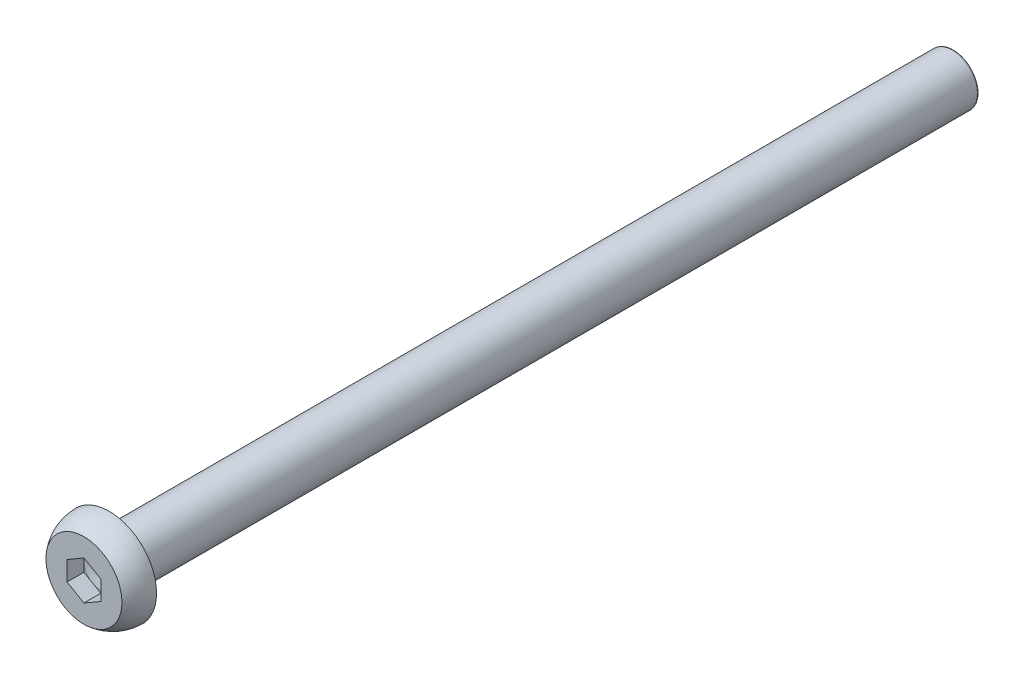
ISO-10303-21;
HEADER;
FILE_DESCRIPTION(('STEP AP214'),'2;1');
FILE_NAME('part.step','',(''),(''),'','','');
FILE_SCHEMA(('AUTOMOTIVE_DESIGN { 1 0 10303 214 1 1 1 1 }'));
ENDSEC;
DATA;
#1=APPLICATION_CONTEXT('core data for automotive mechanical design processes');
#2=APPLICATION_PROTOCOL_DEFINITION('international standard','automotive_design',2000,#1);
#3=PRODUCT_CONTEXT('',#1,'mechanical');
#4=PRODUCT('Part','Part','',(#3));
#5=PRODUCT_RELATED_PRODUCT_CATEGORY('part','',(#4));
#6=PRODUCT_DEFINITION_FORMATION('','',#4);
#7=PRODUCT_DEFINITION_CONTEXT('part definition',#1,'design');
#8=PRODUCT_DEFINITION('design','',#6,#7);
#9=PRODUCT_DEFINITION_SHAPE('','',#8);
#10=(LENGTH_UNIT() NAMED_UNIT(*) SI_UNIT(.MILLI.,.METRE.));
#11=(NAMED_UNIT(*) PLANE_ANGLE_UNIT() SI_UNIT($,.RADIAN.));
#12=(NAMED_UNIT(*) SI_UNIT($,.STERADIAN.) SOLID_ANGLE_UNIT());
#13=UNCERTAINTY_MEASURE_WITH_UNIT(LENGTH_MEASURE(1.E-05),#10,'distance_accuracy_value','');
#14=(GEOMETRIC_REPRESENTATION_CONTEXT(3) GLOBAL_UNCERTAINTY_ASSIGNED_CONTEXT((#13)) GLOBAL_UNIT_ASSIGNED_CONTEXT((#10,
#11,#12)) REPRESENTATION_CONTEXT('',''));
#15=CARTESIAN_POINT('',(0.,0.,0.));
#16=DIRECTION('',(0.,0.,1.));
#17=DIRECTION('',(1.,0.,0.));
#18=AXIS2_PLACEMENT_3D('',#15,#16,#17);
#19=CARTESIAN_POINT('',(0.,1.5,-51.5));
#20=DIRECTION('',(0.,0.,1.));
#21=DIRECTION('',(1.,0.,0.));
#22=AXIS2_PLACEMENT_3D('',#19,#20,#21);
#23=PLANE('',#22);
#24=CARTESIAN_POINT('',(0.,0.,-51.5));
#25=DIRECTION('',(0.,0.,1.));
#26=DIRECTION('',(1.,0.,0.));
#27=AXIS2_PLACEMENT_3D('',#24,#25,#26);
#28=CIRCLE('',#27,1.4);
#29=CARTESIAN_POINT('',(1.4,0.,-51.5));
#30=VERTEX_POINT('',#29);
#31=EDGE_CURVE('E11',#30,#30,#28,.F.);
#32=ORIENTED_EDGE('',*,*,#31,.T.);
#33=EDGE_LOOP('',(#32));
#34=FACE_BOUND('',#33,.T.);
#35=ADVANCED_FACE('F45',(#34),#23,.F.);
#36=CARTESIAN_POINT('',(0.,0.,0.));
#37=DIRECTION('',(0.,0.,1.));
#38=DIRECTION('',(1.,0.,0.));
#39=AXIS2_PLACEMENT_3D('',#36,#37,#38);
#40=CYLINDRICAL_SURFACE('',#39,1.5);
#41=CARTESIAN_POINT('',(0.,0.,-51.4));
#42=DIRECTION('',(0.,0.,1.));
#43=DIRECTION('',(1.,0.,0.));
#44=AXIS2_PLACEMENT_3D('',#41,#42,#43);
#45=CIRCLE('',#44,1.5);
#46=CARTESIAN_POINT('',(1.5,0.,-51.4));
#47=VERTEX_POINT('',#46);
#48=EDGE_CURVE('E54',#47,#47,#45,.T.);
#49=ORIENTED_EDGE('',*,*,#48,.T.);
#50=EDGE_LOOP('',(#49));
#51=FACE_BOUND('',#50,.T.);
#52=CARTESIAN_POINT('',(0.,0.,-1.5));
#53=DIRECTION('',(0.,0.,1.));
#54=DIRECTION('',(1.,0.,0.));
#55=AXIS2_PLACEMENT_3D('',#52,#53,#54);
#56=CIRCLE('',#55,1.5);
#57=CARTESIAN_POINT('',(1.5,0.,-1.5));
#58=VERTEX_POINT('',#57);
#59=EDGE_CURVE('E210',#58,#58,#56,.T.);
#60=ORIENTED_EDGE('',*,*,#59,.F.);
#61=EDGE_LOOP('',(#60));
#62=FACE_BOUND('',#61,.T.);
#63=ADVANCED_FACE('F221',(#51,#62),#40,.T.);
#64=CARTESIAN_POINT('',(0.,2.8,-1.5));
#65=DIRECTION('',(0.,0.,1.));
#66=DIRECTION('',(1.,0.,0.));
#67=AXIS2_PLACEMENT_3D('',#64,#65,#66);
#68=PLANE('',#67);
#69=CARTESIAN_POINT('',(0.,0.,-1.5));
#70=DIRECTION('',(0.,0.,1.));
#71=DIRECTION('',(1.,0.,0.));
#72=AXIS2_PLACEMENT_3D('',#69,#70,#71);
#73=CIRCLE('',#72,2.8);
#74=CARTESIAN_POINT('',(2.8,0.,-1.5));
#75=VERTEX_POINT('',#74);
#76=EDGE_CURVE('E206',#75,#75,#73,.T.);
#77=ORIENTED_EDGE('',*,*,#76,.F.);
#78=EDGE_LOOP('',(#77));
#79=FACE_BOUND('',#78,.T.);
#80=ORIENTED_EDGE('',*,*,#59,.T.);
#81=EDGE_LOOP('',(#80));
#82=FACE_BOUND('',#81,.T.);
#83=ADVANCED_FACE('F238',(#79,#82),#68,.F.);
#84=CARTESIAN_POINT('',(0.,0.,-1.5));
#85=DIRECTION('',(0.,0.,1.));
#86=DIRECTION('',(1.,0.,0.));
#87=AXIS2_PLACEMENT_3D('',#84,#85,#86);
#88=DEGENERATE_TOROIDAL_SURFACE('',#87,0.478438531605624,2.32156146839438,.T.);
#89=CARTESIAN_POINT('',(0.,0.,0.));
#90=DIRECTION('',(0.,0.,1.));
#91=DIRECTION('',(1.,0.,0.));
#92=AXIS2_PLACEMENT_3D('',#89,#90,#91);
#93=CIRCLE('',#92,2.25034362261176);
#94=CARTESIAN_POINT('',(2.25034362261176,0.,0.));
#95=VERTEX_POINT('',#94);
#96=EDGE_CURVE('E191',#95,#95,#93,.T.);
#97=ORIENTED_EDGE('',*,*,#96,.F.);
#98=EDGE_LOOP('',(#97));
#99=FACE_BOUND('',#98,.T.);
#100=ORIENTED_EDGE('',*,*,#76,.T.);
#101=EDGE_LOOP('',(#100));
#102=FACE_BOUND('',#101,.T.);
#103=ADVANCED_FACE('F243',(#99,#102),#88,.T.);
#104=CARTESIAN_POINT('',(0.,1.,0.));
#105=DIRECTION('',(0.,0.,-1.));
#106=DIRECTION('',(-1.,0.,0.));
#107=AXIS2_PLACEMENT_3D('',#104,#105,#106);
#108=PLANE('',#107);
#109=DIRECTION('',(-0.866025403784439,-0.5,0.));
#110=VECTOR('',#109,1.);
#111=CARTESIAN_POINT('',(0.,1.15470053837925,0.));
#112=LINE('',#111,#110);
#113=CARTESIAN_POINT('',(0.,1.15470053837925,0.));
#114=VERTEX_POINT('',#113);
#115=CARTESIAN_POINT('',(-1.,0.577350269189626,0.));
#116=VERTEX_POINT('',#115);
#117=EDGE_CURVE('E170',#114,#116,#112,.T.);
#118=ORIENTED_EDGE('',*,*,#117,.F.);
#119=DIRECTION('',(-0.866025403784439,0.5,0.));
#120=VECTOR('',#119,1.);
#121=CARTESIAN_POINT('',(1.,0.577350269189626,0.));
#122=LINE('',#121,#120);
#123=CARTESIAN_POINT('',(1.,0.577350269189626,0.));
#124=VERTEX_POINT('',#123);
#125=EDGE_CURVE('E61',#124,#114,#122,.T.);
#126=ORIENTED_EDGE('',*,*,#125,.F.);
#127=DIRECTION('',(0.,1.,0.));
#128=VECTOR('',#127,1.);
#129=CARTESIAN_POINT('',(1.,-0.577350269189626,0.));
#130=LINE('',#129,#128);
#131=CARTESIAN_POINT('',(1.,-0.577350269189626,0.));
#132=VERTEX_POINT('',#131);
#133=EDGE_CURVE('E129',#132,#124,#130,.T.);
#134=ORIENTED_EDGE('',*,*,#133,.F.);
#135=DIRECTION('',(0.866025403784439,0.5,0.));
#136=VECTOR('',#135,1.);
#137=CARTESIAN_POINT('',(0.,-1.15470053837925,0.));
#138=LINE('',#137,#136);
#139=CARTESIAN_POINT('',(0.,-1.15470053837925,0.));
#140=VERTEX_POINT('',#139);
#141=EDGE_CURVE('E181',#140,#132,#138,.T.);
#142=ORIENTED_EDGE('',*,*,#141,.F.);
#143=DIRECTION('',(0.866025403784439,-0.5,0.));
#144=VECTOR('',#143,1.);
#145=CARTESIAN_POINT('',(-1.,-0.577350269189626,0.));
#146=LINE('',#145,#144);
#147=CARTESIAN_POINT('',(-1.,-0.577350269189626,0.));
#148=VERTEX_POINT('',#147);
#149=EDGE_CURVE('E177',#148,#140,#146,.T.);
#150=ORIENTED_EDGE('',*,*,#149,.F.);
#151=DIRECTION('',(0.,-1.,0.));
#152=VECTOR('',#151,1.);
#153=CARTESIAN_POINT('',(-1.,0.577350269189626,0.));
#154=LINE('',#153,#152);
#155=EDGE_CURVE('E173',#116,#148,#154,.T.);
#156=ORIENTED_EDGE('',*,*,#155,.F.);
#157=EDGE_LOOP('',(#118,#126,#134,#142,#150,#156));
#158=FACE_BOUND('',#157,.T.);
#159=ORIENTED_EDGE('',*,*,#96,.T.);
#160=EDGE_LOOP('',(#159));
#161=FACE_BOUND('',#160,.T.);
#162=ADVANCED_FACE('F247',(#158,#161),#108,.F.);
#163=CARTESIAN_POINT('',(0.,0.,-1.));
#164=DIRECTION('',(0.,0.,1.));
#165=DIRECTION('',(1.,0.,0.));
#166=AXIS2_PLACEMENT_3D('',#163,#164,#165);
#167=PLANE('',#166);
#168=CARTESIAN_POINT('',(0.,0.,-1.));
#169=DIRECTION('',(0.,0.,1.));
#170=DIRECTION('',(1.,0.,0.));
#171=AXIS2_PLACEMENT_3D('',#168,#169,#170);
#172=CIRCLE('',#171,1.);
#173=CARTESIAN_POINT('',(0.5,-0.866025403784439,-1.));
#174=VERTEX_POINT('',#173);
#175=CARTESIAN_POINT('',(1.,0.,-1.));
#176=VERTEX_POINT('',#175);
#177=EDGE_CURVE('E214',#174,#176,#172,.T.);
#178=ORIENTED_EDGE('',*,*,#177,.F.);
#179=DIRECTION('',(0.866025403784439,0.5,0.));
#180=VECTOR('',#179,1.);
#181=CARTESIAN_POINT('',(0.,-1.15470053837925,-1.));
#182=LINE('',#181,#180);
#183=CARTESIAN_POINT('',(1.,-0.577350269189626,-1.));
#184=VERTEX_POINT('',#183);
#185=EDGE_CURVE('E159',#174,#184,#182,.T.);
#186=ORIENTED_EDGE('',*,*,#185,.T.);
#187=DIRECTION('',(0.,1.,0.));
#188=VECTOR('',#187,1.);
#189=CARTESIAN_POINT('',(1.,-0.577350269189626,-1.));
#190=LINE('',#189,#188);
#191=EDGE_CURVE('E138',#184,#176,#190,.T.);
#192=ORIENTED_EDGE('',*,*,#191,.T.);
#193=EDGE_LOOP('',(#178,#186,#192));
#194=FACE_BOUND('',#193,.T.);
#195=ADVANCED_FACE('F251',(#194),#167,.T.);
#196=CARTESIAN_POINT('',(-0.499999999999999,-0.866025403784438,-1.));
#197=VERTEX_POINT('',#196);
#198=EDGE_CURVE('E297',#197,#174,#172,.T.);
#199=ORIENTED_EDGE('',*,*,#198,.F.);
#200=DIRECTION('',(0.866025403784439,-0.5,0.));
#201=VECTOR('',#200,1.);
#202=CARTESIAN_POINT('',(-1.,-0.577350269189626,-1.));
#203=LINE('',#202,#201);
#204=CARTESIAN_POINT('',(0.,-1.15470053837925,-1.));
#205=VERTEX_POINT('',#204);
#206=EDGE_CURVE('E154',#197,#205,#203,.T.);
#207=ORIENTED_EDGE('',*,*,#206,.T.);
#208=EDGE_CURVE('E160',#205,#174,#182,.T.);
#209=ORIENTED_EDGE('',*,*,#208,.T.);
#210=EDGE_LOOP('',(#199,#207,#209));
#211=FACE_BOUND('',#210,.T.);
#212=ADVANCED_FACE('F275',(#211),#167,.T.);
#213=CARTESIAN_POINT('',(-1.,0.,-1.));
#214=VERTEX_POINT('',#213);
#215=EDGE_CURVE('E300',#214,#197,#172,.T.);
#216=ORIENTED_EDGE('',*,*,#215,.F.);
#217=DIRECTION('',(0.,-1.,0.));
#218=VECTOR('',#217,1.);
#219=CARTESIAN_POINT('',(-1.,0.577350269189626,-1.));
#220=LINE('',#219,#218);
#221=CARTESIAN_POINT('',(-1.,-0.577350269189626,-1.));
#222=VERTEX_POINT('',#221);
#223=EDGE_CURVE('E145',#214,#222,#220,.T.);
#224=ORIENTED_EDGE('',*,*,#223,.T.);
#225=EDGE_CURVE('E155',#222,#197,#203,.T.);
#226=ORIENTED_EDGE('',*,*,#225,.T.);
#227=EDGE_LOOP('',(#216,#224,#226));
#228=FACE_BOUND('',#227,.T.);
#229=ADVANCED_FACE('F280',(#228),#167,.T.);
#230=CARTESIAN_POINT('',(-0.5,0.866025403784439,-1.));
#231=VERTEX_POINT('',#230);
#232=EDGE_CURVE('E302',#231,#214,#172,.T.);
#233=ORIENTED_EDGE('',*,*,#232,.F.);
#234=DIRECTION('',(-0.866025403784439,-0.5,0.));
#235=VECTOR('',#234,1.);
#236=CARTESIAN_POINT('',(0.,1.15470053837925,-1.));
#237=LINE('',#236,#235);
#238=CARTESIAN_POINT('',(-1.,0.577350269189626,-1.));
#239=VERTEX_POINT('',#238);
#240=EDGE_CURVE('E143',#231,#239,#237,.T.);
#241=ORIENTED_EDGE('',*,*,#240,.T.);
#242=EDGE_CURVE('E149',#239,#214,#220,.T.);
#243=ORIENTED_EDGE('',*,*,#242,.T.);
#244=EDGE_LOOP('',(#233,#241,#243));
#245=FACE_BOUND('',#244,.T.);
#246=ADVANCED_FACE('F286',(#245),#167,.T.);
#247=CARTESIAN_POINT('',(0.5,0.866025403784439,-1.));
#248=VERTEX_POINT('',#247);
#249=EDGE_CURVE('E126',#248,#231,#172,.T.);
#250=ORIENTED_EDGE('',*,*,#249,.F.);
#251=DIRECTION('',(-0.866025403784439,0.5,0.));
#252=VECTOR('',#251,1.);
#253=CARTESIAN_POINT('',(1.,0.577350269189626,-1.));
#254=LINE('',#253,#252);
#255=CARTESIAN_POINT('',(0.,1.15470053837925,-1.));
#256=VERTEX_POINT('',#255);
#257=EDGE_CURVE('E121',#248,#256,#254,.T.);
#258=ORIENTED_EDGE('',*,*,#257,.T.);
#259=EDGE_CURVE('E124',#256,#231,#237,.T.);
#260=ORIENTED_EDGE('',*,*,#259,.T.);
#261=EDGE_LOOP('',(#250,#258,#260));
#262=FACE_BOUND('',#261,.T.);
#263=ADVANCED_FACE('F122',(#262),#167,.T.);
#264=EDGE_CURVE('E215',#176,#248,#172,.T.);
#265=ORIENTED_EDGE('',*,*,#264,.F.);
#266=CARTESIAN_POINT('',(1.,0.577350269189626,-1.));
#267=VERTEX_POINT('',#266);
#268=EDGE_CURVE('E164',#176,#267,#190,.T.);
#269=ORIENTED_EDGE('',*,*,#268,.T.);
#270=EDGE_CURVE('E69',#267,#248,#254,.T.);
#271=ORIENTED_EDGE('',*,*,#270,.T.);
#272=EDGE_LOOP('',(#265,#269,#271));
#273=FACE_BOUND('',#272,.T.);
#274=ADVANCED_FACE('F256',(#273),#167,.T.);
#275=CARTESIAN_POINT('',(1.,0.577350269189626,-1.));
#276=DIRECTION('',(0.5,0.866025403784439,0.));
#277=DIRECTION('',(-0.866025403784439,0.5,0.));
#278=AXIS2_PLACEMENT_3D('',#275,#276,#277);
#279=PLANE('',#278);
#280=ORIENTED_EDGE('',*,*,#125,.T.);
#281=DIRECTION('',(0.,0.,1.));
#282=VECTOR('',#281,1.);
#283=CARTESIAN_POINT('',(0.,1.15470053837925,-1.));
#284=LINE('',#283,#282);
#285=EDGE_CURVE('E131',#256,#114,#284,.T.);
#286=ORIENTED_EDGE('',*,*,#285,.F.);
#287=ORIENTED_EDGE('',*,*,#257,.F.);
#288=ORIENTED_EDGE('',*,*,#270,.F.);
#289=DIRECTION('',(0.,0.,1.));
#290=VECTOR('',#289,1.);
#291=CARTESIAN_POINT('',(1.,0.577350269189626,-1.));
#292=LINE('',#291,#290);
#293=EDGE_CURVE('E188',#267,#124,#292,.T.);
#294=ORIENTED_EDGE('',*,*,#293,.T.);
#295=EDGE_LOOP('',(#280,#286,#287,#288,#294));
#296=FACE_BOUND('',#295,.T.);
#297=ADVANCED_FACE('F132',(#296),#279,.F.);
#298=CARTESIAN_POINT('',(1.,-0.577350269189626,-1.));
#299=DIRECTION('',(1.,0.,0.));
#300=DIRECTION('',(0.,1.,0.));
#301=AXIS2_PLACEMENT_3D('',#298,#299,#300);
#302=PLANE('',#301);
#303=ORIENTED_EDGE('',*,*,#133,.T.);
#304=ORIENTED_EDGE('',*,*,#293,.F.);
#305=ORIENTED_EDGE('',*,*,#268,.F.);
#306=ORIENTED_EDGE('',*,*,#191,.F.);
#307=DIRECTION('',(0.,0.,1.));
#308=VECTOR('',#307,1.);
#309=CARTESIAN_POINT('',(1.,-0.577350269189626,-1.));
#310=LINE('',#309,#308);
#311=EDGE_CURVE('E192',#184,#132,#310,.T.);
#312=ORIENTED_EDGE('',*,*,#311,.T.);
#313=EDGE_LOOP('',(#303,#304,#305,#306,#312));
#314=FACE_BOUND('',#313,.T.);
#315=ADVANCED_FACE('F255',(#314),#302,.F.);
#316=CARTESIAN_POINT('',(0.,-1.15470053837925,-1.));
#317=DIRECTION('',(0.5,-0.866025403784439,0.));
#318=DIRECTION('',(0.866025403784439,0.5,0.));
#319=AXIS2_PLACEMENT_3D('',#316,#317,#318);
#320=PLANE('',#319);
#321=ORIENTED_EDGE('',*,*,#141,.T.);
#322=ORIENTED_EDGE('',*,*,#311,.F.);
#323=ORIENTED_EDGE('',*,*,#185,.F.);
#324=ORIENTED_EDGE('',*,*,#208,.F.);
#325=DIRECTION('',(0.,0.,1.));
#326=VECTOR('',#325,1.);
#327=CARTESIAN_POINT('',(0.,-1.15470053837925,-1.));
#328=LINE('',#327,#326);
#329=EDGE_CURVE('E195',#205,#140,#328,.T.);
#330=ORIENTED_EDGE('',*,*,#329,.T.);
#331=EDGE_LOOP('',(#321,#322,#323,#324,#330));
#332=FACE_BOUND('',#331,.T.);
#333=ADVANCED_FACE('F266',(#332),#320,.F.);
#334=CARTESIAN_POINT('',(-1.,-0.577350269189626,-1.));
#335=DIRECTION('',(-0.5,-0.866025403784439,0.));
#336=DIRECTION('',(0.866025403784439,-0.5,0.));
#337=AXIS2_PLACEMENT_3D('',#334,#335,#336);
#338=PLANE('',#337);
#339=ORIENTED_EDGE('',*,*,#149,.T.);
#340=ORIENTED_EDGE('',*,*,#329,.F.);
#341=ORIENTED_EDGE('',*,*,#206,.F.);
#342=ORIENTED_EDGE('',*,*,#225,.F.);
#343=DIRECTION('',(0.,0.,1.));
#344=VECTOR('',#343,1.);
#345=CARTESIAN_POINT('',(-1.,-0.577350269189626,-1.));
#346=LINE('',#345,#344);
#347=EDGE_CURVE('E198',#222,#148,#346,.T.);
#348=ORIENTED_EDGE('',*,*,#347,.T.);
#349=EDGE_LOOP('',(#339,#340,#341,#342,#348));
#350=FACE_BOUND('',#349,.T.);
#351=ADVANCED_FACE('F262',(#350),#338,.F.);
#352=CARTESIAN_POINT('',(-1.,0.577350269189626,-1.));
#353=DIRECTION('',(-1.,0.,0.));
#354=DIRECTION('',(0.,-1.,0.));
#355=AXIS2_PLACEMENT_3D('',#352,#353,#354);
#356=PLANE('',#355);
#357=ORIENTED_EDGE('',*,*,#155,.T.);
#358=ORIENTED_EDGE('',*,*,#347,.F.);
#359=ORIENTED_EDGE('',*,*,#223,.F.);
#360=ORIENTED_EDGE('',*,*,#242,.F.);
#361=DIRECTION('',(0.,0.,1.));
#362=VECTOR('',#361,1.);
#363=CARTESIAN_POINT('',(-1.,0.577350269189626,-1.));
#364=LINE('',#363,#362);
#365=EDGE_CURVE('E137',#239,#116,#364,.T.);
#366=ORIENTED_EDGE('',*,*,#365,.T.);
#367=EDGE_LOOP('',(#357,#358,#359,#360,#366));
#368=FACE_BOUND('',#367,.T.);
#369=ADVANCED_FACE('F259',(#368),#356,.F.);
#370=CARTESIAN_POINT('',(0.,1.15470053837925,-1.));
#371=DIRECTION('',(-0.5,0.866025403784439,0.));
#372=DIRECTION('',(-0.866025403784439,-0.5,0.));
#373=AXIS2_PLACEMENT_3D('',#370,#371,#372);
#374=PLANE('',#373);
#375=ORIENTED_EDGE('',*,*,#117,.T.);
#376=ORIENTED_EDGE('',*,*,#365,.F.);
#377=ORIENTED_EDGE('',*,*,#240,.F.);
#378=ORIENTED_EDGE('',*,*,#259,.F.);
#379=ORIENTED_EDGE('',*,*,#285,.T.);
#380=EDGE_LOOP('',(#375,#376,#377,#378,#379));
#381=FACE_BOUND('',#380,.T.);
#382=ADVANCED_FACE('F141',(#381),#374,.F.);
#383=CARTESIAN_POINT('',(0.,0.,-1.));
#384=DIRECTION('',(0.,0.,1.));
#385=DIRECTION('',(1.,0.,0.));
#386=AXIS2_PLACEMENT_3D('',#383,#384,#385);
#387=CONICAL_SURFACE('',#386,1.,1.32753361128639);
#388=CARTESIAN_POINT('',(0.,0.,-1.2481775856587));
#389=VERTEX_POINT('',#388);
#390=VERTEX_LOOP('',#389);
#391=FACE_BOUND('',#390,.T.);
#392=ORIENTED_EDGE('',*,*,#264,.T.);
#393=ORIENTED_EDGE('',*,*,#249,.T.);
#394=ORIENTED_EDGE('',*,*,#232,.T.);
#395=ORIENTED_EDGE('',*,*,#215,.T.);
#396=ORIENTED_EDGE('',*,*,#198,.T.);
#397=ORIENTED_EDGE('',*,*,#177,.T.);
#398=EDGE_LOOP('',(#392,#393,#394,#395,#396,#397));
#399=FACE_BOUND('',#398,.T.);
#400=ADVANCED_FACE('F225',(#391,#399),#387,.F.);
#401=CARTESIAN_POINT('',(0.,0.,-51.4));
#402=DIRECTION('',(0.,0.,1.));
#403=DIRECTION('',(1.,0.,0.));
#404=AXIS2_PLACEMENT_3D('',#401,#402,#403);
#405=TOROIDAL_SURFACE('',#404,1.4,0.1);
#406=ORIENTED_EDGE('',*,*,#31,.F.);
#407=EDGE_LOOP('',(#406));
#408=FACE_BOUND('',#407,.T.);
#409=ORIENTED_EDGE('',*,*,#48,.F.);
#410=EDGE_LOOP('',(#409));
#411=FACE_BOUND('',#410,.T.);
#412=ADVANCED_FACE('F47',(#408,#411),#405,.T.);
#413=CLOSED_SHELL('',(#35,#63,#83,#103,#162,#195,#212,#229,#246,#263,#274,#297,#315,#333,#351,
#369,#382,#400,#412));
#414=MANIFOLD_SOLID_BREP('B2',#413);
#415=ADVANCED_BREP_SHAPE_REPRESENTATION('',(#18,#414),#14);
#416=SHAPE_DEFINITION_REPRESENTATION(#9,#415);
ENDSEC;
END-ISO-10303-21;
